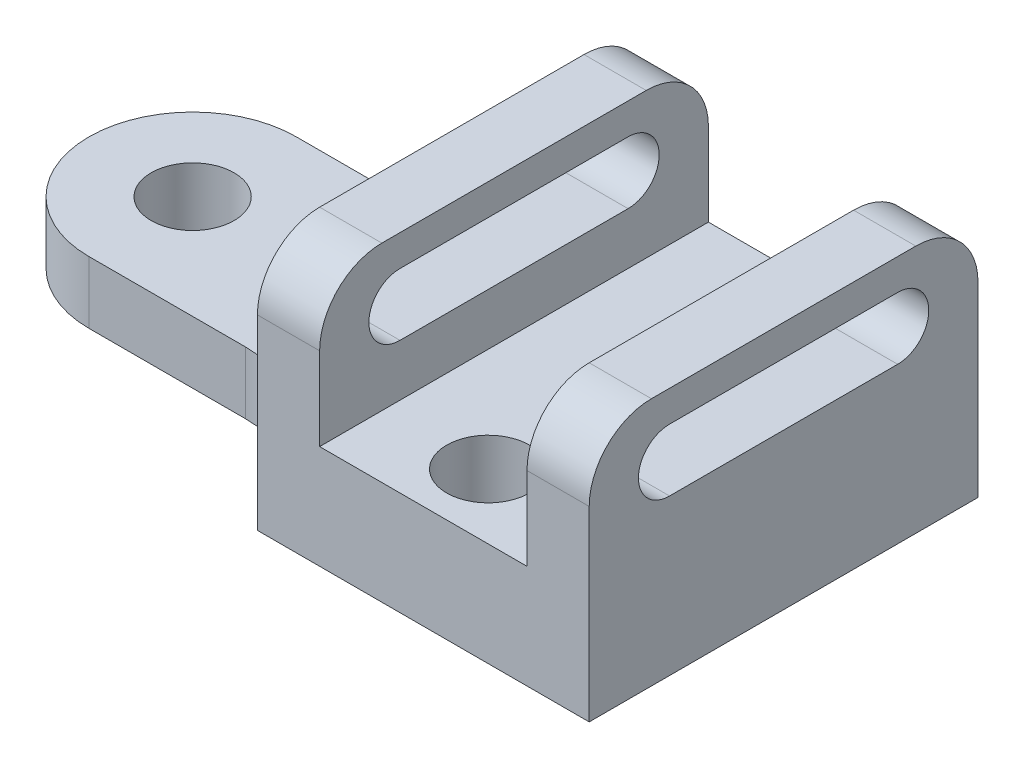
ISO-10303-21;
HEADER;
FILE_DESCRIPTION(('STEP AP214'),'2;1');
FILE_NAME('part.step','',(''),(''),'','','');
FILE_SCHEMA(('AUTOMOTIVE_DESIGN { 1 0 10303 214 1 1 1 1 }'));
ENDSEC;
DATA;
#1=APPLICATION_CONTEXT('core data for automotive mechanical design processes');
#2=APPLICATION_PROTOCOL_DEFINITION('international standard','automotive_design',2000,#1);
#3=PRODUCT_CONTEXT('',#1,'mechanical');
#4=PRODUCT('Part','Part','',(#3));
#5=PRODUCT_RELATED_PRODUCT_CATEGORY('part','',(#4));
#6=PRODUCT_DEFINITION_FORMATION('','',#4);
#7=PRODUCT_DEFINITION_CONTEXT('part definition',#1,'design');
#8=PRODUCT_DEFINITION('design','',#6,#7);
#9=PRODUCT_DEFINITION_SHAPE('','',#8);
#10=(LENGTH_UNIT() NAMED_UNIT(*) SI_UNIT(.MILLI.,.METRE.));
#11=(NAMED_UNIT(*) PLANE_ANGLE_UNIT() SI_UNIT($,.RADIAN.));
#12=(NAMED_UNIT(*) SI_UNIT($,.STERADIAN.) SOLID_ANGLE_UNIT());
#13=UNCERTAINTY_MEASURE_WITH_UNIT(LENGTH_MEASURE(1.E-05),#10,'distance_accuracy_value','');
#14=(GEOMETRIC_REPRESENTATION_CONTEXT(3) GLOBAL_UNCERTAINTY_ASSIGNED_CONTEXT((#13)) GLOBAL_UNIT_ASSIGNED_CONTEXT((#10,
#11,#12)) REPRESENTATION_CONTEXT('',''));
#15=CARTESIAN_POINT('',(0.,0.,0.));
#16=DIRECTION('',(0.,0.,1.));
#17=DIRECTION('',(1.,0.,0.));
#18=AXIS2_PLACEMENT_3D('',#15,#16,#17);
#19=CARTESIAN_POINT('',(0.,0.,-75.));
#20=DIRECTION('',(0.,-1.,0.));
#21=DIRECTION('',(0.,0.,-1.));
#22=AXIS2_PLACEMENT_3D('',#19,#20,#21);
#23=PLANE('',#22);
#24=CARTESIAN_POINT('',(32.,0.,-62.5));
#25=DIRECTION('',(0.,1.,0.));
#26=DIRECTION('',(-1.,0.,0.));
#27=AXIS2_PLACEMENT_3D('',#24,#25,#26);
#28=CIRCLE('',#27,8.);
#29=CARTESIAN_POINT('',(24.,0.,-62.5));
#30=VERTEX_POINT('',#29);
#31=EDGE_CURVE('E283',#30,#30,#28,.T.);
#32=ORIENTED_EDGE('',*,*,#31,.T.);
#33=EDGE_LOOP('',(#32));
#34=FACE_BOUND('',#33,.T.);
#35=CARTESIAN_POINT('',(32.,0.,-12.5));
#36=DIRECTION('',(0.,1.,0.));
#37=DIRECTION('',(-1.,0.,0.));
#38=AXIS2_PLACEMENT_3D('',#35,#36,#37);
#39=CIRCLE('',#38,8.);
#40=CARTESIAN_POINT('',(24.,0.,-12.5));
#41=VERTEX_POINT('',#40);
#42=EDGE_CURVE('E282',#41,#41,#39,.T.);
#43=ORIENTED_EDGE('',*,*,#42,.T.);
#44=EDGE_LOOP('',(#43));
#45=FACE_BOUND('',#44,.T.);
#46=CARTESIAN_POINT('',(-50.,0.,-37.5));
#47=DIRECTION('',(0.,-1.,0.));
#48=DIRECTION('',(0.,0.,-1.));
#49=AXIS2_PLACEMENT_3D('',#46,#47,#48);
#50=CIRCLE('',#49,8.);
#51=CARTESIAN_POINT('',(-50.,0.,-45.5));
#52=VERTEX_POINT('',#51);
#53=EDGE_CURVE('E302',#52,#52,#50,.T.);
#54=ORIENTED_EDGE('',*,*,#53,.F.);
#55=EDGE_LOOP('',(#54));
#56=FACE_BOUND('',#55,.T.);
#57=DIRECTION('',(1.,0.,0.));
#58=VECTOR('',#57,1.);
#59=CARTESIAN_POINT('',(0.,0.,0.));
#60=LINE('',#59,#58);
#61=CARTESIAN_POINT('',(0.,0.,0.));
#62=VERTEX_POINT('',#61);
#63=CARTESIAN_POINT('',(64.,0.,0.));
#64=VERTEX_POINT('',#63);
#65=EDGE_CURVE('E361',#62,#64,#60,.T.);
#66=ORIENTED_EDGE('',*,*,#65,.F.);
#67=CARTESIAN_POINT('',(-19.8431348329844,0.,2.50000000000001));
#68=DIRECTION('',(0.,-1.,0.));
#69=DIRECTION('',(0.,0.,-1.));
#70=AXIS2_PLACEMENT_3D('',#67,#68,#69);
#71=CIRCLE('',#70,20.);
#72=CARTESIAN_POINT('',(-19.8431348329844,0.,-17.5));
#73=VERTEX_POINT('',#72);
#74=EDGE_CURVE('E424',#62,#73,#71,.F.);
#75=ORIENTED_EDGE('',*,*,#74,.T.);
#76=DIRECTION('',(-1.,0.,0.));
#77=VECTOR('',#76,1.);
#78=CARTESIAN_POINT('',(0.,0.,-17.5));
#79=LINE('',#78,#77);
#80=CARTESIAN_POINT('',(-50.,0.,-17.5));
#81=VERTEX_POINT('',#80);
#82=EDGE_CURVE('E314',#73,#81,#79,.T.);
#83=ORIENTED_EDGE('',*,*,#82,.T.);
#84=CARTESIAN_POINT('',(-50.,0.,-37.5));
#85=DIRECTION('',(0.,-1.,0.));
#86=DIRECTION('',(0.,0.,-1.));
#87=AXIS2_PLACEMENT_3D('',#84,#85,#86);
#88=CIRCLE('',#87,20.);
#89=CARTESIAN_POINT('',(-50.,0.,-57.5));
#90=VERTEX_POINT('',#89);
#91=EDGE_CURVE('E330',#81,#90,#88,.T.);
#92=ORIENTED_EDGE('',*,*,#91,.T.);
#93=DIRECTION('',(-1.,0.,0.));
#94=VECTOR('',#93,1.);
#95=CARTESIAN_POINT('',(0.,0.,-57.5));
#96=LINE('',#95,#94);
#97=CARTESIAN_POINT('',(-19.8431348329844,0.,-57.5));
#98=VERTEX_POINT('',#97);
#99=EDGE_CURVE('E327',#98,#90,#96,.T.);
#100=ORIENTED_EDGE('',*,*,#99,.F.);
#101=CARTESIAN_POINT('',(-19.8431348329844,0.,-77.5));
#102=DIRECTION('',(0.,-1.,0.));
#103=DIRECTION('',(0.,0.,-1.));
#104=AXIS2_PLACEMENT_3D('',#101,#102,#103);
#105=CIRCLE('',#104,20.);
#106=CARTESIAN_POINT('',(0.,0.,-75.));
#107=VERTEX_POINT('',#106);
#108=EDGE_CURVE('E417',#98,#107,#105,.F.);
#109=ORIENTED_EDGE('',*,*,#108,.T.);
#110=DIRECTION('',(1.,0.,0.));
#111=VECTOR('',#110,1.);
#112=CARTESIAN_POINT('',(0.,0.,-75.));
#113=LINE('',#112,#111);
#114=CARTESIAN_POINT('',(64.,0.,-75.));
#115=VERTEX_POINT('',#114);
#116=EDGE_CURVE('E338',#107,#115,#113,.T.);
#117=ORIENTED_EDGE('',*,*,#116,.T.);
#118=DIRECTION('',(0.,0.,1.));
#119=VECTOR('',#118,1.);
#120=CARTESIAN_POINT('',(64.,0.,-75.));
#121=LINE('',#120,#119);
#122=EDGE_CURVE('E397',#115,#64,#121,.T.);
#123=ORIENTED_EDGE('',*,*,#122,.T.);
#124=EDGE_LOOP('',(#66,#75,#83,#92,#100,#109,#117,#123));
#125=FACE_BOUND('',#124,.T.);
#126=ADVANCED_FACE('F41',(#34,#45,#56,#125),#23,.T.);
#127=CARTESIAN_POINT('',(0.,12.,-75.));
#128=DIRECTION('',(0.,-1.,0.));
#129=DIRECTION('',(1.,0.,0.));
#130=AXIS2_PLACEMENT_3D('',#127,#128,#129);
#131=PLANE('',#130);
#132=CARTESIAN_POINT('',(-50.,12.,-37.5));
#133=DIRECTION('',(0.,1.,0.));
#134=DIRECTION('',(-1.,0.,0.));
#135=AXIS2_PLACEMENT_3D('',#132,#133,#134);
#136=CIRCLE('',#135,8.);
#137=CARTESIAN_POINT('',(-58.,12.,-37.5));
#138=VERTEX_POINT('',#137);
#139=EDGE_CURVE('E287',#138,#138,#136,.T.);
#140=ORIENTED_EDGE('',*,*,#139,.F.);
#141=EDGE_LOOP('',(#140));
#142=FACE_BOUND('',#141,.T.);
#143=CARTESIAN_POINT('',(-50.,12.,-37.5));
#144=DIRECTION('',(0.,1.,0.));
#145=DIRECTION('',(-1.,0.,0.));
#146=AXIS2_PLACEMENT_3D('',#143,#144,#145);
#147=CIRCLE('',#146,20.);
#148=CARTESIAN_POINT('',(-50.,12.,-57.5));
#149=VERTEX_POINT('',#148);
#150=CARTESIAN_POINT('',(-50.,12.,-17.5));
#151=VERTEX_POINT('',#150);
#152=EDGE_CURVE('E317',#149,#151,#147,.T.);
#153=ORIENTED_EDGE('',*,*,#152,.T.);
#154=DIRECTION('',(1.,0.,0.));
#155=VECTOR('',#154,1.);
#156=CARTESIAN_POINT('',(0.,12.,-17.5));
#157=LINE('',#156,#155);
#158=CARTESIAN_POINT('',(-19.8431348329844,12.,-17.5));
#159=VERTEX_POINT('',#158);
#160=EDGE_CURVE('E306',#151,#159,#157,.T.);
#161=ORIENTED_EDGE('',*,*,#160,.T.);
#162=CARTESIAN_POINT('',(-19.8431348329844,12.,2.50000000000001));
#163=DIRECTION('',(0.,-1.,0.));
#164=DIRECTION('',(1.,0.,0.));
#165=AXIS2_PLACEMENT_3D('',#162,#163,#164);
#166=CIRCLE('',#165,20.);
#167=CARTESIAN_POINT('',(0.,12.,0.));
#168=VERTEX_POINT('',#167);
#169=EDGE_CURVE('E420',#159,#168,#166,.T.);
#170=ORIENTED_EDGE('',*,*,#169,.T.);
#171=DIRECTION('',(0.,0.,1.));
#172=VECTOR('',#171,1.);
#173=CARTESIAN_POINT('',(0.,12.,-75.));
#174=LINE('',#173,#172);
#175=CARTESIAN_POINT('',(0.,12.,-75.));
#176=VERTEX_POINT('',#175);
#177=EDGE_CURVE('E401',#176,#168,#174,.T.);
#178=ORIENTED_EDGE('',*,*,#177,.F.);
#179=CARTESIAN_POINT('',(-19.8431348329844,12.,-77.5));
#180=DIRECTION('',(0.,-1.,0.));
#181=DIRECTION('',(1.,0.,0.));
#182=AXIS2_PLACEMENT_3D('',#179,#180,#181);
#183=CIRCLE('',#182,20.);
#184=CARTESIAN_POINT('',(-19.8431348329844,12.,-57.5));
#185=VERTEX_POINT('',#184);
#186=EDGE_CURVE('E414',#176,#185,#183,.T.);
#187=ORIENTED_EDGE('',*,*,#186,.T.);
#188=DIRECTION('',(1.,0.,0.));
#189=VECTOR('',#188,1.);
#190=CARTESIAN_POINT('',(0.,12.,-57.5));
#191=LINE('',#190,#189);
#192=EDGE_CURVE('E320',#149,#185,#191,.T.);
#193=ORIENTED_EDGE('',*,*,#192,.F.);
#194=EDGE_LOOP('',(#153,#161,#170,#178,#187,#193));
#195=FACE_BOUND('',#194,.T.);
#196=ADVANCED_FACE('F499',(#142,#195),#131,.F.);
#197=CARTESIAN_POINT('',(0.,48.,-75.));
#198=DIRECTION('',(0.,1.,0.));
#199=DIRECTION('',(0.,0.,1.));
#200=AXIS2_PLACEMENT_3D('',#197,#198,#199);
#201=PLANE('',#200);
#202=DIRECTION('',(0.,0.,1.));
#203=VECTOR('',#202,1.);
#204=CARTESIAN_POINT('',(12.,48.,-75.));
#205=LINE('',#204,#203);
#206=CARTESIAN_POINT('',(12.,48.,-63.));
#207=VERTEX_POINT('',#206);
#208=CARTESIAN_POINT('',(12.,48.,-12.));
#209=VERTEX_POINT('',#208);
#210=EDGE_CURVE('E378',#207,#209,#205,.T.);
#211=ORIENTED_EDGE('',*,*,#210,.F.);
#212=DIRECTION('',(-1.,0.,0.));
#213=VECTOR('',#212,1.);
#214=CARTESIAN_POINT('',(0.,48.,-63.));
#215=LINE('',#214,#213);
#216=CARTESIAN_POINT('',(0.,48.,-63.));
#217=VERTEX_POINT('',#216);
#218=EDGE_CURVE('E444',#207,#217,#215,.T.);
#219=ORIENTED_EDGE('',*,*,#218,.T.);
#220=DIRECTION('',(0.,0.,1.));
#221=VECTOR('',#220,1.);
#222=CARTESIAN_POINT('',(0.,48.,-75.));
#223=LINE('',#222,#221);
#224=CARTESIAN_POINT('',(0.,48.,-12.));
#225=VERTEX_POINT('',#224);
#226=EDGE_CURVE('E357',#217,#225,#223,.T.);
#227=ORIENTED_EDGE('',*,*,#226,.T.);
#228=DIRECTION('',(-1.,0.,0.));
#229=VECTOR('',#228,1.);
#230=CARTESIAN_POINT('',(0.,48.,-12.));
#231=LINE('',#230,#229);
#232=EDGE_CURVE('E441',#225,#209,#231,.F.);
#233=ORIENTED_EDGE('',*,*,#232,.T.);
#234=EDGE_LOOP('',(#211,#219,#227,#233));
#235=FACE_BOUND('',#234,.T.);
#236=ADVANCED_FACE('F554',(#235),#201,.T.);
#237=CARTESIAN_POINT('',(12.,0.,-75.));
#238=DIRECTION('',(1.,0.,0.));
#239=DIRECTION('',(0.,0.,-1.));
#240=AXIS2_PLACEMENT_3D('',#237,#238,#239);
#241=PLANE('',#240);
#242=CARTESIAN_POINT('',(12.,36.,-15.5));
#243=DIRECTION('',(1.,0.,0.));
#244=DIRECTION('',(0.,0.,-1.));
#245=AXIS2_PLACEMENT_3D('',#242,#243,#244);
#246=CIRCLE('',#245,6.);
#247=CARTESIAN_POINT('',(12.,42.,-15.5));
#248=VERTEX_POINT('',#247);
#249=CARTESIAN_POINT('',(12.,30.,-15.5));
#250=VERTEX_POINT('',#249);
#251=EDGE_CURVE('E278',#248,#250,#246,.T.);
#252=ORIENTED_EDGE('',*,*,#251,.F.);
#253=DIRECTION('',(0.,0.,-1.));
#254=VECTOR('',#253,1.);
#255=CARTESIAN_POINT('',(12.,42.,-75.));
#256=LINE('',#255,#254);
#257=CARTESIAN_POINT('',(12.,42.,-59.5));
#258=VERTEX_POINT('',#257);
#259=EDGE_CURVE('E271',#248,#258,#256,.T.);
#260=ORIENTED_EDGE('',*,*,#259,.T.);
#261=CARTESIAN_POINT('',(12.,36.,-59.5));
#262=DIRECTION('',(1.,0.,0.));
#263=DIRECTION('',(0.,0.,-1.));
#264=AXIS2_PLACEMENT_3D('',#261,#262,#263);
#265=CIRCLE('',#264,6.);
#266=CARTESIAN_POINT('',(12.,30.,-59.5));
#267=VERTEX_POINT('',#266);
#268=EDGE_CURVE('E264',#267,#258,#265,.T.);
#269=ORIENTED_EDGE('',*,*,#268,.F.);
#270=DIRECTION('',(0.,0.,-1.));
#271=VECTOR('',#270,1.);
#272=CARTESIAN_POINT('',(12.,30.,-75.));
#273=LINE('',#272,#271);
#274=EDGE_CURVE('E259',#250,#267,#273,.T.);
#275=ORIENTED_EDGE('',*,*,#274,.F.);
#276=EDGE_LOOP('',(#252,#260,#269,#275));
#277=FACE_BOUND('',#276,.T.);
#278=DIRECTION('',(0.,1.,0.));
#279=VECTOR('',#278,1.);
#280=CARTESIAN_POINT('',(12.,0.,-75.));
#281=LINE('',#280,#279);
#282=CARTESIAN_POINT('',(12.,20.,-75.));
#283=VERTEX_POINT('',#282);
#284=CARTESIAN_POINT('',(12.,36.,-75.));
#285=VERTEX_POINT('',#284);
#286=EDGE_CURVE('E353',#283,#285,#281,.T.);
#287=ORIENTED_EDGE('',*,*,#286,.T.);
#288=CARTESIAN_POINT('',(12.,36.,-63.));
#289=DIRECTION('',(1.,0.,0.));
#290=DIRECTION('',(0.,0.,-1.));
#291=AXIS2_PLACEMENT_3D('',#288,#289,#290);
#292=CIRCLE('',#291,12.);
#293=EDGE_CURVE('E463',#285,#207,#292,.T.);
#294=ORIENTED_EDGE('',*,*,#293,.T.);
#295=ORIENTED_EDGE('',*,*,#210,.T.);
#296=CARTESIAN_POINT('',(12.,36.,-12.));
#297=DIRECTION('',(1.,0.,0.));
#298=DIRECTION('',(0.,0.,-1.));
#299=AXIS2_PLACEMENT_3D('',#296,#297,#298);
#300=CIRCLE('',#299,12.);
#301=CARTESIAN_POINT('',(12.,36.,0.));
#302=VERTEX_POINT('',#301);
#303=EDGE_CURVE('E460',#209,#302,#300,.T.);
#304=ORIENTED_EDGE('',*,*,#303,.T.);
#305=DIRECTION('',(0.,1.,0.));
#306=VECTOR('',#305,1.);
#307=CARTESIAN_POINT('',(12.,0.,0.));
#308=LINE('',#307,#306);
#309=CARTESIAN_POINT('',(12.,20.,0.));
#310=VERTEX_POINT('',#309);
#311=EDGE_CURVE('E374',#310,#302,#308,.T.);
#312=ORIENTED_EDGE('',*,*,#311,.F.);
#313=DIRECTION('',(0.,0.,1.));
#314=VECTOR('',#313,1.);
#315=CARTESIAN_POINT('',(12.,20.,-75.));
#316=LINE('',#315,#314);
#317=EDGE_CURVE('E383',#283,#310,#316,.T.);
#318=ORIENTED_EDGE('',*,*,#317,.F.);
#319=EDGE_LOOP('',(#287,#294,#295,#304,#312,#318));
#320=FACE_BOUND('',#319,.T.);
#321=ADVANCED_FACE('F526',(#277,#320),#241,.T.);
#322=CARTESIAN_POINT('',(0.,20.,-75.));
#323=DIRECTION('',(0.,1.,0.));
#324=DIRECTION('',(-1.,0.,0.));
#325=AXIS2_PLACEMENT_3D('',#322,#323,#324);
#326=PLANE('',#325);
#327=CARTESIAN_POINT('',(32.,20.,-62.5));
#328=DIRECTION('',(0.,1.,0.));
#329=DIRECTION('',(-1.,0.,0.));
#330=AXIS2_PLACEMENT_3D('',#327,#328,#329);
#331=CIRCLE('',#330,8.);
#332=CARTESIAN_POINT('',(24.,20.,-62.5));
#333=VERTEX_POINT('',#332);
#334=EDGE_CURVE('E288',#333,#333,#331,.T.);
#335=ORIENTED_EDGE('',*,*,#334,.F.);
#336=EDGE_LOOP('',(#335));
#337=FACE_BOUND('',#336,.T.);
#338=CARTESIAN_POINT('',(32.,20.,-12.5));
#339=DIRECTION('',(0.,1.,0.));
#340=DIRECTION('',(-1.,0.,0.));
#341=AXIS2_PLACEMENT_3D('',#338,#339,#340);
#342=CIRCLE('',#341,8.);
#343=CARTESIAN_POINT('',(24.,20.,-12.5));
#344=VERTEX_POINT('',#343);
#345=EDGE_CURVE('E292',#344,#344,#342,.T.);
#346=ORIENTED_EDGE('',*,*,#345,.F.);
#347=EDGE_LOOP('',(#346));
#348=FACE_BOUND('',#347,.T.);
#349=DIRECTION('',(-1.,0.,0.));
#350=VECTOR('',#349,1.);
#351=CARTESIAN_POINT('',(0.,20.,0.));
#352=LINE('',#351,#350);
#353=CARTESIAN_POINT('',(52.,20.,0.));
#354=VERTEX_POINT('',#353);
#355=EDGE_CURVE('E370',#354,#310,#352,.T.);
#356=ORIENTED_EDGE('',*,*,#355,.F.);
#357=DIRECTION('',(0.,0.,1.));
#358=VECTOR('',#357,1.);
#359=CARTESIAN_POINT('',(52.,20.,-75.));
#360=LINE('',#359,#358);
#361=CARTESIAN_POINT('',(52.,20.,-75.));
#362=VERTEX_POINT('',#361);
#363=EDGE_CURVE('E386',#362,#354,#360,.T.);
#364=ORIENTED_EDGE('',*,*,#363,.F.);
#365=DIRECTION('',(-1.,0.,0.));
#366=VECTOR('',#365,1.);
#367=CARTESIAN_POINT('',(0.,20.,-75.));
#368=LINE('',#367,#366);
#369=EDGE_CURVE('E349',#362,#283,#368,.T.);
#370=ORIENTED_EDGE('',*,*,#369,.T.);
#371=ORIENTED_EDGE('',*,*,#317,.T.);
#372=EDGE_LOOP('',(#356,#364,#370,#371));
#373=FACE_BOUND('',#372,.T.);
#374=ADVANCED_FACE('F564',(#337,#348,#373),#326,.T.);
#375=CARTESIAN_POINT('',(52.,0.,-75.));
#376=DIRECTION('',(-1.,0.,0.));
#377=DIRECTION('',(0.,0.,1.));
#378=AXIS2_PLACEMENT_3D('',#375,#376,#377);
#379=PLANE('',#378);
#380=CARTESIAN_POINT('',(52.,36.,-15.5));
#381=DIRECTION('',(-1.,0.,0.));
#382=DIRECTION('',(0.,0.,1.));
#383=AXIS2_PLACEMENT_3D('',#380,#381,#382);
#384=CIRCLE('',#383,6.);
#385=CARTESIAN_POINT('',(52.,30.,-15.5));
#386=VERTEX_POINT('',#385);
#387=CARTESIAN_POINT('',(52.,42.,-15.5));
#388=VERTEX_POINT('',#387);
#389=EDGE_CURVE('E275',#386,#388,#384,.T.);
#390=ORIENTED_EDGE('',*,*,#389,.F.);
#391=DIRECTION('',(0.,0.,1.));
#392=VECTOR('',#391,1.);
#393=CARTESIAN_POINT('',(52.,30.,-75.));
#394=LINE('',#393,#392);
#395=CARTESIAN_POINT('',(52.,30.,-59.5));
#396=VERTEX_POINT('',#395);
#397=EDGE_CURVE('E256',#396,#386,#394,.T.);
#398=ORIENTED_EDGE('',*,*,#397,.F.);
#399=CARTESIAN_POINT('',(52.,36.,-59.5));
#400=DIRECTION('',(-1.,0.,0.));
#401=DIRECTION('',(0.,0.,1.));
#402=AXIS2_PLACEMENT_3D('',#399,#400,#401);
#403=CIRCLE('',#402,6.);
#404=CARTESIAN_POINT('',(52.,42.,-59.5));
#405=VERTEX_POINT('',#404);
#406=EDGE_CURVE('E219',#405,#396,#403,.T.);
#407=ORIENTED_EDGE('',*,*,#406,.F.);
#408=DIRECTION('',(0.,0.,1.));
#409=VECTOR('',#408,1.);
#410=CARTESIAN_POINT('',(52.,42.,-75.));
#411=LINE('',#410,#409);
#412=EDGE_CURVE('E267',#405,#388,#411,.T.);
#413=ORIENTED_EDGE('',*,*,#412,.T.);
#414=EDGE_LOOP('',(#390,#398,#407,#413));
#415=FACE_BOUND('',#414,.T.);
#416=DIRECTION('',(0.,0.,1.));
#417=VECTOR('',#416,1.);
#418=CARTESIAN_POINT('',(52.,48.,-75.));
#419=LINE('',#418,#417);
#420=CARTESIAN_POINT('',(52.,48.,-63.));
#421=VERTEX_POINT('',#420);
#422=CARTESIAN_POINT('',(52.,48.,-12.));
#423=VERTEX_POINT('',#422);
#424=EDGE_CURVE('E390',#421,#423,#419,.T.);
#425=ORIENTED_EDGE('',*,*,#424,.F.);
#426=CARTESIAN_POINT('',(52.,36.,-63.));
#427=DIRECTION('',(-1.,0.,0.));
#428=DIRECTION('',(0.,0.,1.));
#429=AXIS2_PLACEMENT_3D('',#426,#427,#428);
#430=CIRCLE('',#429,12.);
#431=CARTESIAN_POINT('',(52.,36.,-75.));
#432=VERTEX_POINT('',#431);
#433=EDGE_CURVE('E475',#421,#432,#430,.T.);
#434=ORIENTED_EDGE('',*,*,#433,.T.);
#435=DIRECTION('',(0.,-1.,0.));
#436=VECTOR('',#435,1.);
#437=CARTESIAN_POINT('',(52.,0.,-75.));
#438=LINE('',#437,#436);
#439=EDGE_CURVE('E346',#432,#362,#438,.T.);
#440=ORIENTED_EDGE('',*,*,#439,.T.);
#441=ORIENTED_EDGE('',*,*,#363,.T.);
#442=DIRECTION('',(0.,-1.,0.));
#443=VECTOR('',#442,1.);
#444=CARTESIAN_POINT('',(52.,0.,0.));
#445=LINE('',#444,#443);
#446=CARTESIAN_POINT('',(52.,36.,0.));
#447=VERTEX_POINT('',#446);
#448=EDGE_CURVE('E367',#447,#354,#445,.T.);
#449=ORIENTED_EDGE('',*,*,#448,.F.);
#450=CARTESIAN_POINT('',(52.,36.,-12.));
#451=DIRECTION('',(-1.,0.,0.));
#452=DIRECTION('',(0.,0.,1.));
#453=AXIS2_PLACEMENT_3D('',#450,#451,#452);
#454=CIRCLE('',#453,12.);
#455=EDGE_CURVE('E65',#447,#423,#454,.T.);
#456=ORIENTED_EDGE('',*,*,#455,.T.);
#457=EDGE_LOOP('',(#425,#434,#440,#441,#449,#456));
#458=FACE_BOUND('',#457,.T.);
#459=ADVANCED_FACE('F560',(#415,#458),#379,.T.);
#460=CARTESIAN_POINT('',(0.,48.,-75.));
#461=DIRECTION('',(0.,1.,0.));
#462=DIRECTION('',(0.,0.,1.));
#463=AXIS2_PLACEMENT_3D('',#460,#461,#462);
#464=PLANE('',#463);
#465=DIRECTION('',(0.,0.,1.));
#466=VECTOR('',#465,1.);
#467=CARTESIAN_POINT('',(64.,48.,-75.));
#468=LINE('',#467,#466);
#469=CARTESIAN_POINT('',(64.,48.,-63.));
#470=VERTEX_POINT('',#469);
#471=CARTESIAN_POINT('',(64.,48.,-12.));
#472=VERTEX_POINT('',#471);
#473=EDGE_CURVE('E394',#470,#472,#468,.T.);
#474=ORIENTED_EDGE('',*,*,#473,.F.);
#475=DIRECTION('',(-1.,0.,0.));
#476=VECTOR('',#475,1.);
#477=CARTESIAN_POINT('',(52.,48.,-63.));
#478=LINE('',#477,#476);
#479=EDGE_CURVE('E469',#470,#421,#478,.T.);
#480=ORIENTED_EDGE('',*,*,#479,.T.);
#481=ORIENTED_EDGE('',*,*,#424,.T.);
#482=DIRECTION('',(-1.,0.,0.));
#483=VECTOR('',#482,1.);
#484=CARTESIAN_POINT('',(0.,48.,-12.));
#485=LINE('',#484,#483);
#486=EDGE_CURVE('E466',#423,#472,#485,.F.);
#487=ORIENTED_EDGE('',*,*,#486,.T.);
#488=EDGE_LOOP('',(#474,#480,#481,#487));
#489=FACE_BOUND('',#488,.T.);
#490=ADVANCED_FACE('F544',(#489),#464,.T.);
#491=CARTESIAN_POINT('',(64.,0.,-75.));
#492=DIRECTION('',(1.,0.,0.));
#493=DIRECTION('',(0.,0.,-1.));
#494=AXIS2_PLACEMENT_3D('',#491,#492,#493);
#495=PLANE('',#494);
#496=CARTESIAN_POINT('',(64.,36.,-15.5));
#497=DIRECTION('',(1.,0.,0.));
#498=DIRECTION('',(0.,0.,-1.));
#499=AXIS2_PLACEMENT_3D('',#496,#497,#498);
#500=CIRCLE('',#499,6.);
#501=CARTESIAN_POINT('',(64.,42.,-15.5));
#502=VERTEX_POINT('',#501);
#503=CARTESIAN_POINT('',(64.,30.,-15.5));
#504=VERTEX_POINT('',#503);
#505=EDGE_CURVE('E235',#502,#504,#500,.T.);
#506=ORIENTED_EDGE('',*,*,#505,.F.);
#507=DIRECTION('',(0.,0.,-1.));
#508=VECTOR('',#507,1.);
#509=CARTESIAN_POINT('',(64.,42.,-15.5));
#510=LINE('',#509,#508);
#511=CARTESIAN_POINT('',(64.,42.,-59.5));
#512=VERTEX_POINT('',#511);
#513=EDGE_CURVE('E239',#502,#512,#510,.T.);
#514=ORIENTED_EDGE('',*,*,#513,.T.);
#515=CARTESIAN_POINT('',(64.,36.,-59.5));
#516=DIRECTION('',(1.,0.,0.));
#517=DIRECTION('',(0.,0.,-1.));
#518=AXIS2_PLACEMENT_3D('',#515,#516,#517);
#519=CIRCLE('',#518,6.);
#520=CARTESIAN_POINT('',(64.,30.,-59.5));
#521=VERTEX_POINT('',#520);
#522=EDGE_CURVE('E216',#521,#512,#519,.T.);
#523=ORIENTED_EDGE('',*,*,#522,.F.);
#524=DIRECTION('',(0.,0.,-1.));
#525=VECTOR('',#524,1.);
#526=CARTESIAN_POINT('',(64.,30.,-15.5));
#527=LINE('',#526,#525);
#528=EDGE_CURVE('E228',#504,#521,#527,.T.);
#529=ORIENTED_EDGE('',*,*,#528,.F.);
#530=EDGE_LOOP('',(#506,#514,#523,#529));
#531=FACE_BOUND('',#530,.T.);
#532=DIRECTION('',(0.,1.,0.));
#533=VECTOR('',#532,1.);
#534=CARTESIAN_POINT('',(64.,0.,-75.));
#535=LINE('',#534,#533);
#536=CARTESIAN_POINT('',(64.,36.,-75.));
#537=VERTEX_POINT('',#536);
#538=EDGE_CURVE('E342',#115,#537,#535,.T.);
#539=ORIENTED_EDGE('',*,*,#538,.T.);
#540=CARTESIAN_POINT('',(64.,36.,-63.));
#541=DIRECTION('',(1.,0.,0.));
#542=DIRECTION('',(0.,0.,-1.));
#543=AXIS2_PLACEMENT_3D('',#540,#541,#542);
#544=CIRCLE('',#543,12.);
#545=EDGE_CURVE('E480',#537,#470,#544,.T.);
#546=ORIENTED_EDGE('',*,*,#545,.T.);
#547=ORIENTED_EDGE('',*,*,#473,.T.);
#548=CARTESIAN_POINT('',(64.,36.,-12.));
#549=DIRECTION('',(1.,0.,0.));
#550=DIRECTION('',(0.,0.,-1.));
#551=AXIS2_PLACEMENT_3D('',#548,#549,#550);
#552=CIRCLE('',#551,12.);
#553=CARTESIAN_POINT('',(64.,36.,0.));
#554=VERTEX_POINT('',#553);
#555=EDGE_CURVE('E57',#472,#554,#552,.T.);
#556=ORIENTED_EDGE('',*,*,#555,.T.);
#557=DIRECTION('',(0.,1.,0.));
#558=VECTOR('',#557,1.);
#559=CARTESIAN_POINT('',(64.,0.,0.));
#560=LINE('',#559,#558);
#561=EDGE_CURVE('E364',#64,#554,#560,.T.);
#562=ORIENTED_EDGE('',*,*,#561,.F.);
#563=ORIENTED_EDGE('',*,*,#122,.F.);
#564=EDGE_LOOP('',(#539,#546,#547,#556,#562,#563));
#565=FACE_BOUND('',#564,.T.);
#566=ADVANCED_FACE('F237',(#531,#565),#495,.T.);
#567=CARTESIAN_POINT('',(0.,0.,-75.));
#568=DIRECTION('',(-1.,0.,0.));
#569=DIRECTION('',(0.,-1.,0.));
#570=AXIS2_PLACEMENT_3D('',#567,#568,#569);
#571=PLANE('',#570);
#572=CARTESIAN_POINT('',(0.,36.,-15.5));
#573=DIRECTION('',(-1.,0.,0.));
#574=DIRECTION('',(0.,-1.,0.));
#575=AXIS2_PLACEMENT_3D('',#572,#573,#574);
#576=CIRCLE('',#575,6.);
#577=CARTESIAN_POINT('',(0.,30.,-15.5));
#578=VERTEX_POINT('',#577);
#579=CARTESIAN_POINT('',(0.,42.,-15.5));
#580=VERTEX_POINT('',#579);
#581=EDGE_CURVE('E438',#578,#580,#576,.T.);
#582=ORIENTED_EDGE('',*,*,#581,.F.);
#583=DIRECTION('',(0.,0.,1.));
#584=VECTOR('',#583,1.);
#585=CARTESIAN_POINT('',(0.,30.,-75.));
#586=LINE('',#585,#584);
#587=CARTESIAN_POINT('',(0.,30.,-59.5));
#588=VERTEX_POINT('',#587);
#589=EDGE_CURVE('E427',#588,#578,#586,.T.);
#590=ORIENTED_EDGE('',*,*,#589,.F.);
#591=CARTESIAN_POINT('',(0.,36.,-59.5));
#592=DIRECTION('',(-1.,0.,0.));
#593=DIRECTION('',(0.,-1.,0.));
#594=AXIS2_PLACEMENT_3D('',#591,#592,#593);
#595=CIRCLE('',#594,6.);
#596=CARTESIAN_POINT('',(0.,42.,-59.5));
#597=VERTEX_POINT('',#596);
#598=EDGE_CURVE('E430',#597,#588,#595,.T.);
#599=ORIENTED_EDGE('',*,*,#598,.F.);
#600=DIRECTION('',(0.,0.,1.));
#601=VECTOR('',#600,1.);
#602=CARTESIAN_POINT('',(0.,42.,-75.));
#603=LINE('',#602,#601);
#604=EDGE_CURVE('E434',#597,#580,#603,.T.);
#605=ORIENTED_EDGE('',*,*,#604,.T.);
#606=EDGE_LOOP('',(#582,#590,#599,#605));
#607=FACE_BOUND('',#606,.T.);
#608=ORIENTED_EDGE('',*,*,#226,.F.);
#609=CARTESIAN_POINT('',(0.,36.,-63.));
#610=DIRECTION('',(-1.,0.,0.));
#611=DIRECTION('',(0.,-1.,0.));
#612=AXIS2_PLACEMENT_3D('',#609,#610,#611);
#613=CIRCLE('',#612,12.);
#614=CARTESIAN_POINT('',(0.,36.,-75.));
#615=VERTEX_POINT('',#614);
#616=EDGE_CURVE('E451',#217,#615,#613,.T.);
#617=ORIENTED_EDGE('',*,*,#616,.T.);
#618=DIRECTION('',(0.,-1.,0.));
#619=VECTOR('',#618,1.);
#620=CARTESIAN_POINT('',(0.,0.,-75.));
#621=LINE('',#620,#619);
#622=EDGE_CURVE('E335',#615,#176,#621,.T.);
#623=ORIENTED_EDGE('',*,*,#622,.T.);
#624=ORIENTED_EDGE('',*,*,#177,.T.);
#625=DIRECTION('',(0.,-1.,0.));
#626=VECTOR('',#625,1.);
#627=CARTESIAN_POINT('',(0.,0.,0.));
#628=LINE('',#627,#626);
#629=CARTESIAN_POINT('',(0.,36.,0.));
#630=VERTEX_POINT('',#629);
#631=EDGE_CURVE('E358',#630,#168,#628,.T.);
#632=ORIENTED_EDGE('',*,*,#631,.F.);
#633=CARTESIAN_POINT('',(0.,36.,-12.));
#634=DIRECTION('',(-1.,0.,0.));
#635=DIRECTION('',(0.,-1.,0.));
#636=AXIS2_PLACEMENT_3D('',#633,#634,#635);
#637=CIRCLE('',#636,12.);
#638=EDGE_CURVE('E448',#630,#225,#637,.T.);
#639=ORIENTED_EDGE('',*,*,#638,.T.);
#640=EDGE_LOOP('',(#608,#617,#623,#624,#632,#639));
#641=FACE_BOUND('',#640,.T.);
#642=ADVANCED_FACE('F493',(#607,#641),#571,.T.);
#643=CARTESIAN_POINT('',(0.,0.,-75.));
#644=DIRECTION('',(0.,0.,1.));
#645=DIRECTION('',(1.,0.,0.));
#646=AXIS2_PLACEMENT_3D('',#643,#644,#645);
#647=PLANE('',#646);
#648=ORIENTED_EDGE('',*,*,#622,.F.);
#649=DIRECTION('',(-1.,0.,0.));
#650=VECTOR('',#649,1.);
#651=CARTESIAN_POINT('',(12.,36.,-75.));
#652=LINE('',#651,#650);
#653=EDGE_CURVE('E457',#615,#285,#652,.F.);
#654=ORIENTED_EDGE('',*,*,#653,.T.);
#655=ORIENTED_EDGE('',*,*,#286,.F.);
#656=ORIENTED_EDGE('',*,*,#369,.F.);
#657=ORIENTED_EDGE('',*,*,#439,.F.);
#658=DIRECTION('',(-1.,0.,0.));
#659=VECTOR('',#658,1.);
#660=CARTESIAN_POINT('',(64.,36.,-75.));
#661=LINE('',#660,#659);
#662=EDGE_CURVE('E454',#432,#537,#661,.F.);
#663=ORIENTED_EDGE('',*,*,#662,.T.);
#664=ORIENTED_EDGE('',*,*,#538,.F.);
#665=ORIENTED_EDGE('',*,*,#116,.F.);
#666=EDGE_CURVE('E339',#176,#107,#621,.T.);
#667=ORIENTED_EDGE('',*,*,#666,.F.);
#668=EDGE_LOOP('',(#648,#654,#655,#656,#657,#663,#664,#665,#667));
#669=FACE_BOUND('',#668,.T.);
#670=ADVANCED_FACE('F536',(#669),#647,.F.);
#671=CARTESIAN_POINT('',(0.,0.,0.));
#672=DIRECTION('',(0.,0.,1.));
#673=DIRECTION('',(1.,0.,0.));
#674=AXIS2_PLACEMENT_3D('',#671,#672,#673);
#675=PLANE('',#674);
#676=ORIENTED_EDGE('',*,*,#561,.T.);
#677=DIRECTION('',(-1.,0.,0.));
#678=VECTOR('',#677,1.);
#679=CARTESIAN_POINT('',(0.,36.,0.));
#680=LINE('',#679,#678);
#681=EDGE_CURVE('E11',#554,#447,#680,.T.);
#682=ORIENTED_EDGE('',*,*,#681,.T.);
#683=ORIENTED_EDGE('',*,*,#448,.T.);
#684=ORIENTED_EDGE('',*,*,#355,.T.);
#685=ORIENTED_EDGE('',*,*,#311,.T.);
#686=DIRECTION('',(-1.,0.,0.));
#687=VECTOR('',#686,1.);
#688=CARTESIAN_POINT('',(0.,36.,0.));
#689=LINE('',#688,#687);
#690=EDGE_CURVE('E50',#302,#630,#689,.T.);
#691=ORIENTED_EDGE('',*,*,#690,.T.);
#692=ORIENTED_EDGE('',*,*,#631,.T.);
#693=EDGE_CURVE('E334',#168,#62,#628,.T.);
#694=ORIENTED_EDGE('',*,*,#693,.T.);
#695=ORIENTED_EDGE('',*,*,#65,.T.);
#696=EDGE_LOOP('',(#676,#682,#683,#684,#685,#691,#692,#694,#695));
#697=FACE_BOUND('',#696,.T.);
#698=ADVANCED_FACE('F487',(#697),#675,.T.);
#699=CARTESIAN_POINT('',(-50.,-63.,-37.5));
#700=DIRECTION('',(0.,1.,0.));
#701=DIRECTION('',(-1.,0.,0.));
#702=AXIS2_PLACEMENT_3D('',#699,#700,#701);
#703=CYLINDRICAL_SURFACE('',#702,20.);
#704=ORIENTED_EDGE('',*,*,#91,.F.);
#705=DIRECTION('',(0.,1.,0.));
#706=VECTOR('',#705,1.);
#707=CARTESIAN_POINT('',(-50.,-63.,-17.5));
#708=LINE('',#707,#706);
#709=EDGE_CURVE('E310',#81,#151,#708,.T.);
#710=ORIENTED_EDGE('',*,*,#709,.T.);
#711=ORIENTED_EDGE('',*,*,#152,.F.);
#712=DIRECTION('',(0.,1.,0.));
#713=VECTOR('',#712,1.);
#714=CARTESIAN_POINT('',(-50.,-63.,-57.5));
#715=LINE('',#714,#713);
#716=EDGE_CURVE('E324',#90,#149,#715,.T.);
#717=ORIENTED_EDGE('',*,*,#716,.F.);
#718=EDGE_LOOP('',(#704,#710,#711,#717));
#719=FACE_BOUND('',#718,.T.);
#720=ADVANCED_FACE('F572',(#719),#703,.T.);
#721=CARTESIAN_POINT('',(0.,-63.,-57.5));
#722=DIRECTION('',(0.,0.,1.));
#723=DIRECTION('',(1.,0.,0.));
#724=AXIS2_PLACEMENT_3D('',#721,#722,#723);
#725=PLANE('',#724);
#726=ORIENTED_EDGE('',*,*,#192,.T.);
#727=DIRECTION('',(0.,1.,0.));
#728=VECTOR('',#727,1.);
#729=CARTESIAN_POINT('',(-19.8431348329844,-63.,-57.5));
#730=LINE('',#729,#728);
#731=EDGE_CURVE('E382',#185,#98,#730,.F.);
#732=ORIENTED_EDGE('',*,*,#731,.T.);
#733=ORIENTED_EDGE('',*,*,#99,.T.);
#734=ORIENTED_EDGE('',*,*,#716,.T.);
#735=EDGE_LOOP('',(#726,#732,#733,#734));
#736=FACE_BOUND('',#735,.T.);
#737=ADVANCED_FACE('F576',(#736),#725,.F.);
#738=CARTESIAN_POINT('',(0.,-63.,-17.5));
#739=DIRECTION('',(0.,0.,1.));
#740=DIRECTION('',(1.,0.,0.));
#741=AXIS2_PLACEMENT_3D('',#738,#739,#740);
#742=PLANE('',#741);
#743=ORIENTED_EDGE('',*,*,#82,.F.);
#744=DIRECTION('',(0.,-1.,0.));
#745=VECTOR('',#744,1.);
#746=CARTESIAN_POINT('',(-19.8431348329844,12.,-17.5));
#747=LINE('',#746,#745);
#748=EDGE_CURVE('E410',#73,#159,#747,.F.);
#749=ORIENTED_EDGE('',*,*,#748,.T.);
#750=ORIENTED_EDGE('',*,*,#160,.F.);
#751=ORIENTED_EDGE('',*,*,#709,.F.);
#752=EDGE_LOOP('',(#743,#749,#750,#751));
#753=FACE_BOUND('',#752,.T.);
#754=ADVANCED_FACE('F580',(#753),#742,.T.);
#755=CARTESIAN_POINT('',(-19.8431348329844,0.,-77.5));
#756=DIRECTION('',(0.,1.,0.));
#757=DIRECTION('',(-1.,0.,0.));
#758=AXIS2_PLACEMENT_3D('',#755,#756,#757);
#759=CYLINDRICAL_SURFACE('',#758,20.);
#760=ORIENTED_EDGE('',*,*,#108,.F.);
#761=ORIENTED_EDGE('',*,*,#731,.F.);
#762=ORIENTED_EDGE('',*,*,#186,.F.);
#763=ORIENTED_EDGE('',*,*,#666,.T.);
#764=EDGE_LOOP('',(#760,#761,#762,#763));
#765=FACE_BOUND('',#764,.T.);
#766=ADVANCED_FACE('F584',(#765),#759,.F.);
#767=CARTESIAN_POINT('',(-19.8431348329844,0.,2.50000000000001));
#768=DIRECTION('',(0.,1.,0.));
#769=DIRECTION('',(-1.,0.,0.));
#770=AXIS2_PLACEMENT_3D('',#767,#768,#769);
#771=CYLINDRICAL_SURFACE('',#770,20.);
#772=ORIENTED_EDGE('',*,*,#74,.F.);
#773=ORIENTED_EDGE('',*,*,#693,.F.);
#774=ORIENTED_EDGE('',*,*,#169,.F.);
#775=ORIENTED_EDGE('',*,*,#748,.F.);
#776=EDGE_LOOP('',(#772,#773,#774,#775));
#777=FACE_BOUND('',#776,.T.);
#778=ADVANCED_FACE('F504',(#777),#771,.F.);
#779=CARTESIAN_POINT('',(-50.,-8.00000000000001,-37.5));
#780=DIRECTION('',(0.,1.,0.));
#781=DIRECTION('',(-1.,0.,0.));
#782=AXIS2_PLACEMENT_3D('',#779,#780,#781);
#783=CYLINDRICAL_SURFACE('',#782,8.);
#784=ORIENTED_EDGE('',*,*,#53,.T.);
#785=EDGE_LOOP('',(#784));
#786=FACE_BOUND('',#785,.T.);
#787=ORIENTED_EDGE('',*,*,#139,.T.);
#788=EDGE_LOOP('',(#787));
#789=FACE_BOUND('',#788,.T.);
#790=ADVANCED_FACE('F586',(#786,#789),#783,.F.);
#791=CARTESIAN_POINT('',(32.,0.,-12.5));
#792=DIRECTION('',(0.,1.,0.));
#793=DIRECTION('',(-1.,0.,0.));
#794=AXIS2_PLACEMENT_3D('',#791,#792,#793);
#795=CYLINDRICAL_SURFACE('',#794,8.);
#796=ORIENTED_EDGE('',*,*,#42,.F.);
#797=EDGE_LOOP('',(#796));
#798=FACE_BOUND('',#797,.T.);
#799=ORIENTED_EDGE('',*,*,#345,.T.);
#800=EDGE_LOOP('',(#799));
#801=FACE_BOUND('',#800,.T.);
#802=ADVANCED_FACE('F589',(#798,#801),#795,.F.);
#803=CARTESIAN_POINT('',(32.,0.,-62.5));
#804=DIRECTION('',(0.,1.,0.));
#805=DIRECTION('',(-1.,0.,0.));
#806=AXIS2_PLACEMENT_3D('',#803,#804,#805);
#807=CYLINDRICAL_SURFACE('',#806,8.);
#808=ORIENTED_EDGE('',*,*,#31,.F.);
#809=EDGE_LOOP('',(#808));
#810=FACE_BOUND('',#809,.T.);
#811=ORIENTED_EDGE('',*,*,#334,.T.);
#812=EDGE_LOOP('',(#811));
#813=FACE_BOUND('',#812,.T.);
#814=ADVANCED_FACE('F593',(#810,#813),#807,.F.);
#815=CARTESIAN_POINT('',(-70.,30.,-15.5));
#816=DIRECTION('',(0.,-1.,0.));
#817=DIRECTION('',(0.,0.,-1.));
#818=AXIS2_PLACEMENT_3D('',#815,#816,#817);
#819=PLANE('',#818);
#820=ORIENTED_EDGE('',*,*,#274,.T.);
#821=DIRECTION('',(1.,0.,0.));
#822=VECTOR('',#821,1.);
#823=CARTESIAN_POINT('',(-70.,30.,-59.5));
#824=LINE('',#823,#822);
#825=EDGE_CURVE('E223',#588,#267,#824,.T.);
#826=ORIENTED_EDGE('',*,*,#825,.F.);
#827=ORIENTED_EDGE('',*,*,#589,.T.);
#828=DIRECTION('',(1.,0.,0.));
#829=VECTOR('',#828,1.);
#830=CARTESIAN_POINT('',(-70.,30.,-15.5));
#831=LINE('',#830,#829);
#832=EDGE_CURVE('E224',#578,#250,#831,.T.);
#833=ORIENTED_EDGE('',*,*,#832,.T.);
#834=EDGE_LOOP('',(#820,#826,#827,#833));
#835=FACE_BOUND('',#834,.T.);
#836=ADVANCED_FACE('F516',(#835),#819,.F.);
#837=CARTESIAN_POINT('',(-70.,36.,-59.5));
#838=DIRECTION('',(1.,0.,0.));
#839=DIRECTION('',(0.,0.,-1.));
#840=AXIS2_PLACEMENT_3D('',#837,#838,#839);
#841=CYLINDRICAL_SURFACE('',#840,6.);
#842=ORIENTED_EDGE('',*,*,#268,.T.);
#843=DIRECTION('',(1.,0.,0.));
#844=VECTOR('',#843,1.);
#845=CARTESIAN_POINT('',(-70.,42.,-59.5));
#846=LINE('',#845,#844);
#847=EDGE_CURVE('E250',#597,#258,#846,.T.);
#848=ORIENTED_EDGE('',*,*,#847,.F.);
#849=ORIENTED_EDGE('',*,*,#598,.T.);
#850=ORIENTED_EDGE('',*,*,#825,.T.);
#851=EDGE_LOOP('',(#842,#848,#849,#850));
#852=FACE_BOUND('',#851,.T.);
#853=ADVANCED_FACE('F530',(#852),#841,.F.);
#854=CARTESIAN_POINT('',(-70.,42.,-15.5));
#855=DIRECTION('',(0.,-1.,0.));
#856=DIRECTION('',(0.,0.,-1.));
#857=AXIS2_PLACEMENT_3D('',#854,#855,#856);
#858=PLANE('',#857);
#859=DIRECTION('',(1.,0.,0.));
#860=VECTOR('',#859,1.);
#861=CARTESIAN_POINT('',(-70.,42.,-15.5));
#862=LINE('',#861,#860);
#863=EDGE_CURVE('E249',#580,#248,#862,.T.);
#864=ORIENTED_EDGE('',*,*,#863,.F.);
#865=ORIENTED_EDGE('',*,*,#604,.F.);
#866=ORIENTED_EDGE('',*,*,#847,.T.);
#867=ORIENTED_EDGE('',*,*,#259,.F.);
#868=EDGE_LOOP('',(#864,#865,#866,#867));
#869=FACE_BOUND('',#868,.T.);
#870=ADVANCED_FACE('F533',(#869),#858,.T.);
#871=CARTESIAN_POINT('',(-70.,36.,-15.5));
#872=DIRECTION('',(1.,0.,0.));
#873=DIRECTION('',(0.,0.,-1.));
#874=AXIS2_PLACEMENT_3D('',#871,#872,#873);
#875=CYLINDRICAL_SURFACE('',#874,6.);
#876=ORIENTED_EDGE('',*,*,#251,.T.);
#877=ORIENTED_EDGE('',*,*,#832,.F.);
#878=ORIENTED_EDGE('',*,*,#581,.T.);
#879=ORIENTED_EDGE('',*,*,#863,.T.);
#880=EDGE_LOOP('',(#876,#877,#878,#879));
#881=FACE_BOUND('',#880,.T.);
#882=ADVANCED_FACE('F522',(#881),#875,.F.);
#883=ORIENTED_EDGE('',*,*,#389,.T.);
#884=EDGE_CURVE('E246',#388,#502,#862,.T.);
#885=ORIENTED_EDGE('',*,*,#884,.T.);
#886=ORIENTED_EDGE('',*,*,#505,.T.);
#887=EDGE_CURVE('E231',#386,#504,#831,.T.);
#888=ORIENTED_EDGE('',*,*,#887,.F.);
#889=EDGE_LOOP('',(#883,#885,#886,#888));
#890=FACE_BOUND('',#889,.T.);
#891=ADVANCED_FACE('F598',(#890),#875,.F.);
#892=EDGE_CURVE('E251',#405,#512,#846,.T.);
#893=ORIENTED_EDGE('',*,*,#892,.T.);
#894=ORIENTED_EDGE('',*,*,#513,.F.);
#895=ORIENTED_EDGE('',*,*,#884,.F.);
#896=ORIENTED_EDGE('',*,*,#412,.F.);
#897=EDGE_LOOP('',(#893,#894,#895,#896));
#898=FACE_BOUND('',#897,.T.);
#899=ADVANCED_FACE('F601',(#898),#858,.T.);
#900=ORIENTED_EDGE('',*,*,#406,.T.);
#901=EDGE_CURVE('E211',#396,#521,#824,.T.);
#902=ORIENTED_EDGE('',*,*,#901,.T.);
#903=ORIENTED_EDGE('',*,*,#522,.T.);
#904=ORIENTED_EDGE('',*,*,#892,.F.);
#905=EDGE_LOOP('',(#900,#902,#903,#904));
#906=FACE_BOUND('',#905,.T.);
#907=ADVANCED_FACE('F213',(#906),#841,.F.);
#908=ORIENTED_EDGE('',*,*,#397,.T.);
#909=ORIENTED_EDGE('',*,*,#887,.T.);
#910=ORIENTED_EDGE('',*,*,#528,.T.);
#911=ORIENTED_EDGE('',*,*,#901,.F.);
#912=EDGE_LOOP('',(#908,#909,#910,#911));
#913=FACE_BOUND('',#912,.T.);
#914=ADVANCED_FACE('F229',(#913),#819,.F.);
#915=CARTESIAN_POINT('',(0.,36.,-63.));
#916=DIRECTION('',(1.,0.,0.));
#917=DIRECTION('',(0.,0.,-1.));
#918=AXIS2_PLACEMENT_3D('',#915,#916,#917);
#919=CYLINDRICAL_SURFACE('',#918,12.);
#920=ORIENTED_EDGE('',*,*,#293,.F.);
#921=ORIENTED_EDGE('',*,*,#653,.F.);
#922=ORIENTED_EDGE('',*,*,#616,.F.);
#923=ORIENTED_EDGE('',*,*,#218,.F.);
#924=EDGE_LOOP('',(#920,#921,#922,#923));
#925=FACE_BOUND('',#924,.T.);
#926=ADVANCED_FACE('F605',(#925),#919,.T.);
#927=CARTESIAN_POINT('',(0.,36.,-63.));
#928=DIRECTION('',(1.,0.,0.));
#929=DIRECTION('',(0.,0.,-1.));
#930=AXIS2_PLACEMENT_3D('',#927,#928,#929);
#931=CYLINDRICAL_SURFACE('',#930,12.);
#932=ORIENTED_EDGE('',*,*,#545,.F.);
#933=ORIENTED_EDGE('',*,*,#662,.F.);
#934=ORIENTED_EDGE('',*,*,#433,.F.);
#935=ORIENTED_EDGE('',*,*,#479,.F.);
#936=EDGE_LOOP('',(#932,#933,#934,#935));
#937=FACE_BOUND('',#936,.T.);
#938=ADVANCED_FACE('F776',(#937),#931,.T.);
#939=CARTESIAN_POINT('',(0.,36.,-12.));
#940=DIRECTION('',(-1.,0.,0.));
#941=DIRECTION('',(0.,0.,1.));
#942=AXIS2_PLACEMENT_3D('',#939,#940,#941);
#943=CYLINDRICAL_SURFACE('',#942,12.);
#944=ORIENTED_EDGE('',*,*,#555,.F.);
#945=ORIENTED_EDGE('',*,*,#486,.F.);
#946=ORIENTED_EDGE('',*,*,#455,.F.);
#947=ORIENTED_EDGE('',*,*,#681,.F.);
#948=EDGE_LOOP('',(#944,#945,#946,#947));
#949=FACE_BOUND('',#948,.T.);
#950=ADVANCED_FACE('F783',(#949),#943,.T.);
#951=CARTESIAN_POINT('',(0.,36.,-12.));
#952=DIRECTION('',(-1.,0.,0.));
#953=DIRECTION('',(0.,0.,1.));
#954=AXIS2_PLACEMENT_3D('',#951,#952,#953);
#955=CYLINDRICAL_SURFACE('',#954,12.);
#956=ORIENTED_EDGE('',*,*,#303,.F.);
#957=ORIENTED_EDGE('',*,*,#232,.F.);
#958=ORIENTED_EDGE('',*,*,#638,.F.);
#959=ORIENTED_EDGE('',*,*,#690,.F.);
#960=EDGE_LOOP('',(#956,#957,#958,#959));
#961=FACE_BOUND('',#960,.T.);
#962=ADVANCED_FACE('F43',(#961),#955,.T.);
#963=CLOSED_SHELL('',(#126,#196,#236,#321,#374,#459,#490,#566,#642,#670,#698,#720,#737,#754,
#766,#778,#790,#802,#814,#836,#853,#870,#882,#891,#899,#907,#914,#926,#938,#950,#962));
#964=MANIFOLD_SOLID_BREP('B2',#963);
#965=ADVANCED_BREP_SHAPE_REPRESENTATION('',(#18,#964),#14);
#966=SHAPE_DEFINITION_REPRESENTATION(#9,#965);
ENDSEC;
END-ISO-10303-21;
